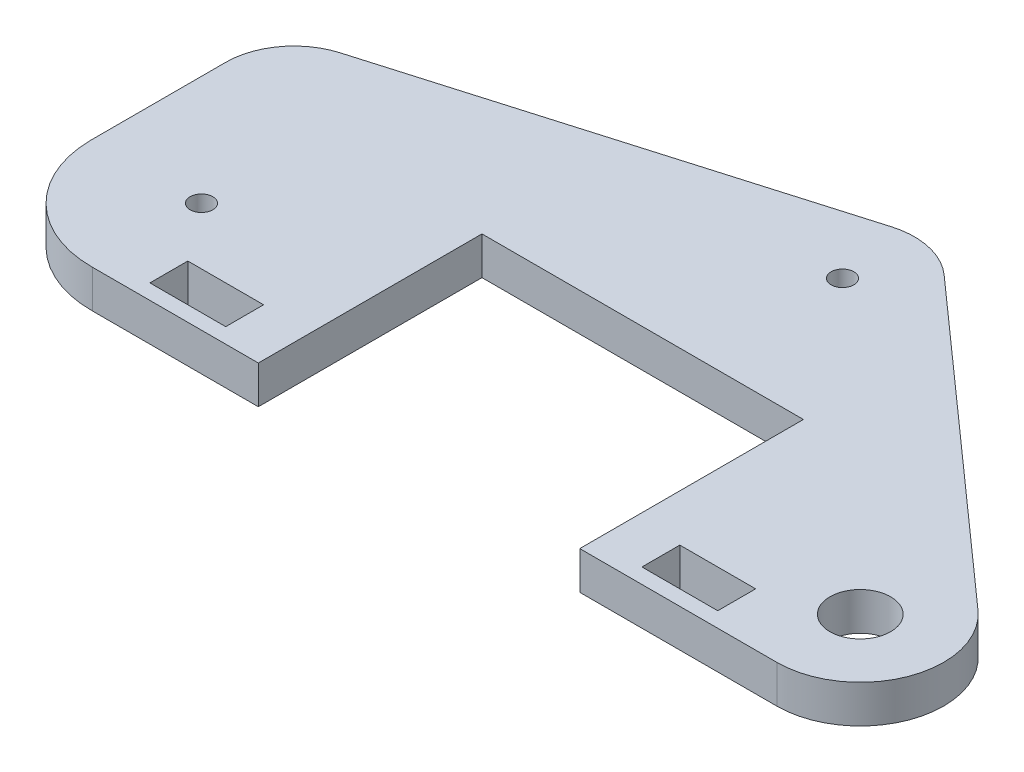
ISO-10303-21;
HEADER;
FILE_DESCRIPTION(('STEP AP214'),'2;1');
FILE_NAME('part.step','',(''),(''),'','','');
FILE_SCHEMA(('AUTOMOTIVE_DESIGN { 1 0 10303 214 1 1 1 1 }'));
ENDSEC;
DATA;
#1=APPLICATION_CONTEXT('core data for automotive mechanical design processes');
#2=APPLICATION_PROTOCOL_DEFINITION('international standard','automotive_design',2000,#1);
#3=PRODUCT_CONTEXT('',#1,'mechanical');
#4=PRODUCT('Part','Part','',(#3));
#5=PRODUCT_RELATED_PRODUCT_CATEGORY('part','',(#4));
#6=PRODUCT_DEFINITION_FORMATION('','',#4);
#7=PRODUCT_DEFINITION_CONTEXT('part definition',#1,'design');
#8=PRODUCT_DEFINITION('design','',#6,#7);
#9=PRODUCT_DEFINITION_SHAPE('','',#8);
#10=(LENGTH_UNIT() NAMED_UNIT(*) SI_UNIT(.MILLI.,.METRE.));
#11=(NAMED_UNIT(*) PLANE_ANGLE_UNIT() SI_UNIT($,.RADIAN.));
#12=(NAMED_UNIT(*) SI_UNIT($,.STERADIAN.) SOLID_ANGLE_UNIT());
#13=UNCERTAINTY_MEASURE_WITH_UNIT(LENGTH_MEASURE(1.E-05),#10,'distance_accuracy_value','');
#14=(GEOMETRIC_REPRESENTATION_CONTEXT(3) GLOBAL_UNCERTAINTY_ASSIGNED_CONTEXT((#13)) GLOBAL_UNIT_ASSIGNED_CONTEXT((#10,
#11,#12)) REPRESENTATION_CONTEXT('',''));
#15=CARTESIAN_POINT('',(0.,0.,0.));
#16=DIRECTION('',(0.,0.,1.));
#17=DIRECTION('',(1.,0.,0.));
#18=AXIS2_PLACEMENT_3D('',#15,#16,#17);
#19=CARTESIAN_POINT('',(90.4028342932197,5.,3.49963534397116));
#20=DIRECTION('',(0.,1.,0.));
#21=DIRECTION('',(0.,0.,1.));
#22=AXIS2_PLACEMENT_3D('',#19,#20,#21);
#23=PLANE('',#22);
#24=DIRECTION('',(0.,0.,-1.));
#25=VECTOR('',#24,1.);
#26=CARTESIAN_POINT('',(15.7,5.,7.49963534397117));
#27=LINE('',#26,#25);
#28=CARTESIAN_POINT('',(15.7,5.,12.4996353439712));
#29=VERTEX_POINT('',#28);
#30=CARTESIAN_POINT('',(15.7,5.,7.49963534397117));
#31=VERTEX_POINT('',#30);
#32=EDGE_CURVE('E240',#29,#31,#27,.T.);
#33=ORIENTED_EDGE('',*,*,#32,.F.);
#34=DIRECTION('',(1.,0.,0.));
#35=VECTOR('',#34,1.);
#36=CARTESIAN_POINT('',(15.7,5.,12.4996353439712));
#37=LINE('',#36,#35);
#38=CARTESIAN_POINT('',(5.7,5.,12.4996353439712));
#39=VERTEX_POINT('',#38);
#40=EDGE_CURVE('E237',#39,#29,#37,.T.);
#41=ORIENTED_EDGE('',*,*,#40,.F.);
#42=DIRECTION('',(0.,0.,1.));
#43=VECTOR('',#42,1.);
#44=CARTESIAN_POINT('',(5.7,5.,12.4996353439712));
#45=LINE('',#44,#43);
#46=CARTESIAN_POINT('',(5.7,5.,7.49963534397117));
#47=VERTEX_POINT('',#46);
#48=EDGE_CURVE('E248',#47,#39,#45,.T.);
#49=ORIENTED_EDGE('',*,*,#48,.F.);
#50=DIRECTION('',(-1.,0.,0.));
#51=VECTOR('',#50,1.);
#52=CARTESIAN_POINT('',(5.7,5.,7.49963534397117));
#53=LINE('',#52,#51);
#54=EDGE_CURVE('E244',#31,#47,#53,.T.);
#55=ORIENTED_EDGE('',*,*,#54,.F.);
#56=EDGE_LOOP('',(#33,#41,#49,#55));
#57=FACE_BOUND('',#56,.T.);
#58=CARTESIAN_POINT('',(90.4028342932197,5.,3.49963534397116));
#59=DIRECTION('',(0.,1.,0.));
#60=DIRECTION('',(0.,0.,1.));
#61=AXIS2_PLACEMENT_3D('',#58,#59,#60);
#62=CIRCLE('',#61,4.00000000000001);
#63=CARTESIAN_POINT('',(90.4028342932197,5.,7.49963534397117));
#64=VERTEX_POINT('',#63);
#65=EDGE_CURVE('E280',#64,#64,#62,.T.);
#66=ORIENTED_EDGE('',*,*,#65,.F.);
#67=EDGE_LOOP('',(#66));
#68=FACE_BOUND('',#67,.T.);
#69=DIRECTION('',(0.,0.,1.));
#70=VECTOR('',#69,1.);
#71=CARTESIAN_POINT('',(64.4028342932197,5.,-15.0003646560288));
#72=LINE('',#71,#70);
#73=CARTESIAN_POINT('',(64.4028342932197,5.,-15.0003646560288));
#74=VERTEX_POINT('',#73);
#75=CARTESIAN_POINT('',(64.4028342932197,5.,14.4996353439712));
#76=VERTEX_POINT('',#75);
#77=EDGE_CURVE('E296',#74,#76,#72,.T.);
#78=ORIENTED_EDGE('',*,*,#77,.T.);
#79=DIRECTION('',(1.,0.,0.));
#80=VECTOR('',#79,1.);
#81=CARTESIAN_POINT('',(64.4028342932197,5.,14.4996353439712));
#82=LINE('',#81,#80);
#83=CARTESIAN_POINT('',(90.4028342932197,5.,14.4996353439711));
#84=VERTEX_POINT('',#83);
#85=EDGE_CURVE('E300',#76,#84,#82,.T.);
#86=ORIENTED_EDGE('',*,*,#85,.T.);
#87=CARTESIAN_POINT('',(90.4028342932197,5.,3.49963534397116));
#88=DIRECTION('',(0.,1.,0.));
#89=DIRECTION('',(0.,0.,1.));
#90=AXIS2_PLACEMENT_3D('',#87,#88,#89);
#91=CIRCLE('',#90,11.);
#92=CARTESIAN_POINT('',(97.7151031431947,5.,-4.71807262514555));
#93=VERTEX_POINT('',#92);
#94=EDGE_CURVE('E304',#84,#93,#91,.T.);
#95=ORIENTED_EDGE('',*,*,#94,.T.);
#96=DIRECTION('',(-0.747064360828861,0.,-0.664751713634019));
#97=VECTOR('',#96,1.);
#98=CARTESIAN_POINT('',(57.1685900471543,5.,-40.79711142787));
#99=LINE('',#98,#97);
#100=CARTESIAN_POINT('',(57.1685900471542,5.,-40.7971114278699));
#101=VERTEX_POINT('',#100);
#102=EDGE_CURVE('E307',#93,#101,#99,.T.);
#103=ORIENTED_EDGE('',*,*,#102,.T.);
#104=CARTESIAN_POINT('',(50.8534487676347,5.,-33.7));
#105=DIRECTION('',(0.,1.,0.));
#106=DIRECTION('',(0.,0.,1.));
#107=AXIS2_PLACEMENT_3D('',#104,#105,#106);
#108=CIRCLE('',#107,9.49999999999435);
#109=CARTESIAN_POINT('',(48.1803960763869,5.,-42.8161828255966));
#110=VERTEX_POINT('',#109);
#111=EDGE_CURVE('E310',#101,#110,#108,.T.);
#112=ORIENTED_EDGE('',*,*,#111,.T.);
#113=DIRECTION('',(-0.959598192168644,0.,0.281373967499963));
#114=VECTOR('',#113,1.);
#115=CARTESIAN_POINT('',(-8.03200105147063,5.,-26.3335494362987));
#116=LINE('',#115,#114);
#117=CARTESIAN_POINT('',(-8.03200105147056,5.,-26.3335494362985));
#118=VERTEX_POINT('',#117);
#119=EDGE_CURVE('E313',#110,#118,#116,.T.);
#120=ORIENTED_EDGE('',*,*,#119,.T.);
#121=CARTESIAN_POINT('',(-5.49963534397116,5.,-17.6971657067804));
#122=DIRECTION('',(0.,1.,0.));
#123=DIRECTION('',(0.,0.,1.));
#124=AXIS2_PLACEMENT_3D('',#121,#122,#123);
#125=CIRCLE('',#124,9.00000000000024);
#126=CARTESIAN_POINT('',(-14.4996353439712,5.,-17.6971657067806));
#127=VERTEX_POINT('',#126);
#128=EDGE_CURVE('E316',#118,#127,#125,.T.);
#129=ORIENTED_EDGE('',*,*,#128,.T.);
#130=DIRECTION('',(0.,0.,1.));
#131=VECTOR('',#130,1.);
#132=CARTESIAN_POINT('',(-14.4996353439712,5.,0.102834293219351));
#133=LINE('',#132,#131);
#134=CARTESIAN_POINT('',(-14.4996353439712,5.,0.102834293219355));
#135=VERTEX_POINT('',#134);
#136=EDGE_CURVE('E319',#127,#135,#133,.T.);
#137=ORIENTED_EDGE('',*,*,#136,.T.);
#138=CARTESIAN_POINT('',(0.,5.,0.));
#139=DIRECTION('',(0.,1.,0.));
#140=DIRECTION('',(0.,0.,1.));
#141=AXIS2_PLACEMENT_3D('',#138,#139,#140);
#142=CIRCLE('',#141,14.5);
#143=CARTESIAN_POINT('',(0.102834293219708,5.,14.4996353439712));
#144=VERTEX_POINT('',#143);
#145=EDGE_CURVE('E322',#135,#144,#142,.T.);
#146=ORIENTED_EDGE('',*,*,#145,.T.);
#147=DIRECTION('',(1.,0.,0.));
#148=VECTOR('',#147,1.);
#149=CARTESIAN_POINT('',(0.102834293219708,5.,14.4996353439712));
#150=LINE('',#149,#148);
#151=CARTESIAN_POINT('',(22.0028342932197,5.,14.4996353439712));
#152=VERTEX_POINT('',#151);
#153=EDGE_CURVE('E325',#144,#152,#150,.T.);
#154=ORIENTED_EDGE('',*,*,#153,.T.);
#155=DIRECTION('',(0.,0.,-1.));
#156=VECTOR('',#155,1.);
#157=CARTESIAN_POINT('',(22.0028342932197,5.,14.4996353439712));
#158=LINE('',#157,#156);
#159=CARTESIAN_POINT('',(22.0028342932197,5.,-15.0003646560288));
#160=VERTEX_POINT('',#159);
#161=EDGE_CURVE('E328',#152,#160,#158,.T.);
#162=ORIENTED_EDGE('',*,*,#161,.T.);
#163=DIRECTION('',(1.,0.,0.));
#164=VECTOR('',#163,1.);
#165=CARTESIAN_POINT('',(22.0028342932197,5.,-15.0003646560288));
#166=LINE('',#165,#164);
#167=EDGE_CURVE('E331',#160,#74,#166,.T.);
#168=ORIENTED_EDGE('',*,*,#167,.T.);
#169=EDGE_LOOP('',(#78,#86,#95,#103,#112,#120,#129,#137,#146,#154,#162,#168));
#170=FACE_BOUND('',#169,.T.);
#171=CARTESIAN_POINT('',(0.,5.,0.));
#172=DIRECTION('',(0.,1.,0.));
#173=DIRECTION('',(0.,0.,1.));
#174=AXIS2_PLACEMENT_3D('',#171,#172,#173);
#175=CIRCLE('',#174,1.5);
#176=CARTESIAN_POINT('',(0.,5.,1.5));
#177=VERTEX_POINT('',#176);
#178=EDGE_CURVE('E288',#177,#177,#175,.T.);
#179=ORIENTED_EDGE('',*,*,#178,.F.);
#180=EDGE_LOOP('',(#179));
#181=FACE_BOUND('',#180,.T.);
#182=CARTESIAN_POINT('',(50.8534487676347,5.,-33.7));
#183=DIRECTION('',(0.,1.,0.));
#184=DIRECTION('',(0.,0.,1.));
#185=AXIS2_PLACEMENT_3D('',#182,#183,#184);
#186=CIRCLE('',#185,1.5);
#187=CARTESIAN_POINT('',(50.8534487676347,5.,-32.2));
#188=VERTEX_POINT('',#187);
#189=EDGE_CURVE('E229',#188,#188,#186,.T.);
#190=ORIENTED_EDGE('',*,*,#189,.F.);
#191=EDGE_LOOP('',(#190));
#192=FACE_BOUND('',#191,.T.);
#193=DIRECTION('',(1.,0.,0.));
#194=VECTOR('',#193,1.);
#195=CARTESIAN_POINT('',(70.6028342932197,5.,12.4996353439712));
#196=LINE('',#195,#194);
#197=CARTESIAN_POINT('',(70.6028342932197,5.,12.4996353439712));
#198=VERTEX_POINT('',#197);
#199=CARTESIAN_POINT('',(80.6028342932197,5.,12.4996353439712));
#200=VERTEX_POINT('',#199);
#201=EDGE_CURVE('E190',#198,#200,#196,.T.);
#202=ORIENTED_EDGE('',*,*,#201,.F.);
#203=DIRECTION('',(0.,0.,1.));
#204=VECTOR('',#203,1.);
#205=CARTESIAN_POINT('',(70.6028342932197,5.,7.49963534397117));
#206=LINE('',#205,#204);
#207=CARTESIAN_POINT('',(70.6028342932197,5.,7.49963534397117));
#208=VERTEX_POINT('',#207);
#209=EDGE_CURVE('E181',#208,#198,#206,.T.);
#210=ORIENTED_EDGE('',*,*,#209,.F.);
#211=DIRECTION('',(-1.,0.,0.));
#212=VECTOR('',#211,1.);
#213=CARTESIAN_POINT('',(80.6028342932197,5.,7.49963534397117));
#214=LINE('',#213,#212);
#215=CARTESIAN_POINT('',(80.6028342932197,5.,7.49963534397117));
#216=VERTEX_POINT('',#215);
#217=EDGE_CURVE('E207',#216,#208,#214,.T.);
#218=ORIENTED_EDGE('',*,*,#217,.F.);
#219=DIRECTION('',(0.,0.,-1.));
#220=VECTOR('',#219,1.);
#221=CARTESIAN_POINT('',(80.6028342932197,5.,12.4996353439712));
#222=LINE('',#221,#220);
#223=EDGE_CURVE('E203',#200,#216,#222,.T.);
#224=ORIENTED_EDGE('',*,*,#223,.F.);
#225=EDGE_LOOP('',(#202,#210,#218,#224));
#226=FACE_BOUND('',#225,.T.);
#227=ADVANCED_FACE('F43',(#57,#68,#170,#181,#192,#226),#23,.T.);
#228=CARTESIAN_POINT('',(90.4028342932197,0.,3.49963534397116));
#229=DIRECTION('',(0.,1.,0.));
#230=DIRECTION('',(0.,0.,1.));
#231=AXIS2_PLACEMENT_3D('',#228,#229,#230);
#232=PLANE('',#231);
#233=CARTESIAN_POINT('',(50.8534487676347,0.,-33.7));
#234=DIRECTION('',(0.,1.,0.));
#235=DIRECTION('',(0.,0.,1.));
#236=AXIS2_PLACEMENT_3D('',#233,#234,#235);
#237=CIRCLE('',#236,1.5);
#238=CARTESIAN_POINT('',(50.8534487676347,0.,-32.2));
#239=VERTEX_POINT('',#238);
#240=EDGE_CURVE('E199',#239,#239,#237,.T.);
#241=ORIENTED_EDGE('',*,*,#240,.T.);
#242=EDGE_LOOP('',(#241));
#243=FACE_BOUND('',#242,.T.);
#244=DIRECTION('',(1.,0.,0.));
#245=VECTOR('',#244,1.);
#246=CARTESIAN_POINT('',(15.7,0.,12.4996353439712));
#247=LINE('',#246,#245);
#248=CARTESIAN_POINT('',(5.7,0.,12.4996353439712));
#249=VERTEX_POINT('',#248);
#250=CARTESIAN_POINT('',(15.7,0.,12.4996353439712));
#251=VERTEX_POINT('',#250);
#252=EDGE_CURVE('E233',#249,#251,#247,.T.);
#253=ORIENTED_EDGE('',*,*,#252,.T.);
#254=DIRECTION('',(0.,0.,-1.));
#255=VECTOR('',#254,1.);
#256=CARTESIAN_POINT('',(15.7,0.,7.49963534397117));
#257=LINE('',#256,#255);
#258=CARTESIAN_POINT('',(15.7,0.,7.49963534397117));
#259=VERTEX_POINT('',#258);
#260=EDGE_CURVE('E255',#251,#259,#257,.T.);
#261=ORIENTED_EDGE('',*,*,#260,.T.);
#262=DIRECTION('',(-1.,0.,0.));
#263=VECTOR('',#262,1.);
#264=CARTESIAN_POINT('',(5.7,0.,7.49963534397117));
#265=LINE('',#264,#263);
#266=CARTESIAN_POINT('',(5.7,0.,7.49963534397117));
#267=VERTEX_POINT('',#266);
#268=EDGE_CURVE('E259',#259,#267,#265,.T.);
#269=ORIENTED_EDGE('',*,*,#268,.T.);
#270=DIRECTION('',(0.,0.,1.));
#271=VECTOR('',#270,1.);
#272=CARTESIAN_POINT('',(5.7,0.,12.4996353439712));
#273=LINE('',#272,#271);
#274=EDGE_CURVE('E241',#267,#249,#273,.T.);
#275=ORIENTED_EDGE('',*,*,#274,.T.);
#276=EDGE_LOOP('',(#253,#261,#269,#275));
#277=FACE_BOUND('',#276,.T.);
#278=DIRECTION('',(0.,0.,1.));
#279=VECTOR('',#278,1.);
#280=CARTESIAN_POINT('',(64.4028342932197,0.,-15.0003646560288));
#281=LINE('',#280,#279);
#282=CARTESIAN_POINT('',(64.4028342932197,0.,-15.0003646560288));
#283=VERTEX_POINT('',#282);
#284=CARTESIAN_POINT('',(64.4028342932197,0.,14.4996353439712));
#285=VERTEX_POINT('',#284);
#286=EDGE_CURVE('E292',#283,#285,#281,.T.);
#287=ORIENTED_EDGE('',*,*,#286,.F.);
#288=DIRECTION('',(1.,0.,0.));
#289=VECTOR('',#288,1.);
#290=CARTESIAN_POINT('',(22.0028342932197,0.,-15.0003646560288));
#291=LINE('',#290,#289);
#292=CARTESIAN_POINT('',(22.0028342932197,0.,-15.0003646560288));
#293=VERTEX_POINT('',#292);
#294=EDGE_CURVE('E301',#293,#283,#291,.T.);
#295=ORIENTED_EDGE('',*,*,#294,.F.);
#296=DIRECTION('',(0.,0.,-1.));
#297=VECTOR('',#296,1.);
#298=CARTESIAN_POINT('',(22.0028342932197,0.,14.4996353439712));
#299=LINE('',#298,#297);
#300=CARTESIAN_POINT('',(22.0028342932197,0.,14.4996353439712));
#301=VERTEX_POINT('',#300);
#302=EDGE_CURVE('E365',#301,#293,#299,.T.);
#303=ORIENTED_EDGE('',*,*,#302,.F.);
#304=DIRECTION('',(1.,0.,0.));
#305=VECTOR('',#304,1.);
#306=CARTESIAN_POINT('',(0.102834293219708,0.,14.4996353439712));
#307=LINE('',#306,#305);
#308=CARTESIAN_POINT('',(0.102834293219708,0.,14.4996353439712));
#309=VERTEX_POINT('',#308);
#310=EDGE_CURVE('E362',#309,#301,#307,.T.);
#311=ORIENTED_EDGE('',*,*,#310,.F.);
#312=CARTESIAN_POINT('',(0.,0.,0.));
#313=DIRECTION('',(0.,1.,0.));
#314=DIRECTION('',(0.,0.,1.));
#315=AXIS2_PLACEMENT_3D('',#312,#313,#314);
#316=CIRCLE('',#315,14.5);
#317=CARTESIAN_POINT('',(-14.4996353439712,0.,0.102834293219355));
#318=VERTEX_POINT('',#317);
#319=EDGE_CURVE('E359',#318,#309,#316,.T.);
#320=ORIENTED_EDGE('',*,*,#319,.F.);
#321=DIRECTION('',(0.,0.,1.));
#322=VECTOR('',#321,1.);
#323=CARTESIAN_POINT('',(-14.4996353439712,0.,0.102834293219351));
#324=LINE('',#323,#322);
#325=CARTESIAN_POINT('',(-14.4996353439712,0.,-17.6971657067806));
#326=VERTEX_POINT('',#325);
#327=EDGE_CURVE('E356',#326,#318,#324,.T.);
#328=ORIENTED_EDGE('',*,*,#327,.F.);
#329=CARTESIAN_POINT('',(-5.49963534397116,0.,-17.6971657067804));
#330=DIRECTION('',(0.,1.,0.));
#331=DIRECTION('',(0.,0.,1.));
#332=AXIS2_PLACEMENT_3D('',#329,#330,#331);
#333=CIRCLE('',#332,9.00000000000024);
#334=CARTESIAN_POINT('',(-8.03200105147056,0.,-26.3335494362985));
#335=VERTEX_POINT('',#334);
#336=EDGE_CURVE('E353',#335,#326,#333,.T.);
#337=ORIENTED_EDGE('',*,*,#336,.F.);
#338=DIRECTION('',(-0.959598192168644,0.,0.281373967499963));
#339=VECTOR('',#338,1.);
#340=CARTESIAN_POINT('',(-8.03200105147063,0.,-26.3335494362987));
#341=LINE('',#340,#339);
#342=CARTESIAN_POINT('',(48.1803960763869,0.,-42.8161828255966));
#343=VERTEX_POINT('',#342);
#344=EDGE_CURVE('E350',#343,#335,#341,.T.);
#345=ORIENTED_EDGE('',*,*,#344,.F.);
#346=CARTESIAN_POINT('',(50.8534487676347,0.,-33.7));
#347=DIRECTION('',(0.,1.,0.));
#348=DIRECTION('',(0.,0.,1.));
#349=AXIS2_PLACEMENT_3D('',#346,#347,#348);
#350=CIRCLE('',#349,9.49999999999435);
#351=CARTESIAN_POINT('',(57.1685900471542,0.,-40.7971114278699));
#352=VERTEX_POINT('',#351);
#353=EDGE_CURVE('E347',#352,#343,#350,.T.);
#354=ORIENTED_EDGE('',*,*,#353,.F.);
#355=DIRECTION('',(-0.747064360828861,0.,-0.664751713634019));
#356=VECTOR('',#355,1.);
#357=CARTESIAN_POINT('',(57.1685900471543,0.,-40.79711142787));
#358=LINE('',#357,#356);
#359=CARTESIAN_POINT('',(97.7151031431947,0.,-4.71807262514555));
#360=VERTEX_POINT('',#359);
#361=EDGE_CURVE('E344',#360,#352,#358,.T.);
#362=ORIENTED_EDGE('',*,*,#361,.F.);
#363=CARTESIAN_POINT('',(90.4028342932197,0.,3.49963534397116));
#364=DIRECTION('',(0.,1.,0.));
#365=DIRECTION('',(0.,0.,1.));
#366=AXIS2_PLACEMENT_3D('',#363,#364,#365);
#367=CIRCLE('',#366,11.);
#368=CARTESIAN_POINT('',(90.4028342932197,0.,14.4996353439711));
#369=VERTEX_POINT('',#368);
#370=EDGE_CURVE('E341',#369,#360,#367,.T.);
#371=ORIENTED_EDGE('',*,*,#370,.F.);
#372=DIRECTION('',(1.,0.,0.));
#373=VECTOR('',#372,1.);
#374=CARTESIAN_POINT('',(64.4028342932197,0.,14.4996353439712));
#375=LINE('',#374,#373);
#376=EDGE_CURVE('E338',#285,#369,#375,.T.);
#377=ORIENTED_EDGE('',*,*,#376,.F.);
#378=EDGE_LOOP('',(#287,#295,#303,#311,#320,#328,#337,#345,#354,#362,#371,#377));
#379=FACE_BOUND('',#378,.T.);
#380=CARTESIAN_POINT('',(0.,0.,0.));
#381=DIRECTION('',(0.,1.,0.));
#382=DIRECTION('',(0.,0.,1.));
#383=AXIS2_PLACEMENT_3D('',#380,#381,#382);
#384=CIRCLE('',#383,1.5);
#385=CARTESIAN_POINT('',(0.,0.,1.5));
#386=VERTEX_POINT('',#385);
#387=EDGE_CURVE('E284',#386,#386,#384,.T.);
#388=ORIENTED_EDGE('',*,*,#387,.T.);
#389=EDGE_LOOP('',(#388));
#390=FACE_BOUND('',#389,.T.);
#391=CARTESIAN_POINT('',(90.4028342932197,0.,3.49963534397116));
#392=DIRECTION('',(0.,1.,0.));
#393=DIRECTION('',(0.,0.,1.));
#394=AXIS2_PLACEMENT_3D('',#391,#392,#393);
#395=CIRCLE('',#394,4.00000000000001);
#396=CARTESIAN_POINT('',(90.4028342932197,0.,7.49963534397117));
#397=VERTEX_POINT('',#396);
#398=EDGE_CURVE('E279',#397,#397,#395,.T.);
#399=ORIENTED_EDGE('',*,*,#398,.T.);
#400=EDGE_LOOP('',(#399));
#401=FACE_BOUND('',#400,.T.);
#402=DIRECTION('',(0.,0.,1.));
#403=VECTOR('',#402,1.);
#404=CARTESIAN_POINT('',(70.6028342932197,0.,7.49963534397117));
#405=LINE('',#404,#403);
#406=CARTESIAN_POINT('',(70.6028342932197,0.,7.49963534397117));
#407=VERTEX_POINT('',#406);
#408=CARTESIAN_POINT('',(70.6028342932197,0.,12.4996353439712));
#409=VERTEX_POINT('',#408);
#410=EDGE_CURVE('E67',#407,#409,#405,.T.);
#411=ORIENTED_EDGE('',*,*,#410,.T.);
#412=DIRECTION('',(1.,0.,0.));
#413=VECTOR('',#412,1.);
#414=CARTESIAN_POINT('',(70.6028342932197,0.,12.4996353439712));
#415=LINE('',#414,#413);
#416=CARTESIAN_POINT('',(80.6028342932197,0.,12.4996353439712));
#417=VERTEX_POINT('',#416);
#418=EDGE_CURVE('E197',#409,#417,#415,.T.);
#419=ORIENTED_EDGE('',*,*,#418,.T.);
#420=DIRECTION('',(0.,0.,-1.));
#421=VECTOR('',#420,1.);
#422=CARTESIAN_POINT('',(80.6028342932197,0.,12.4996353439712));
#423=LINE('',#422,#421);
#424=CARTESIAN_POINT('',(80.6028342932197,0.,7.49963534397117));
#425=VERTEX_POINT('',#424);
#426=EDGE_CURVE('E216',#417,#425,#423,.T.);
#427=ORIENTED_EDGE('',*,*,#426,.T.);
#428=DIRECTION('',(-1.,0.,0.));
#429=VECTOR('',#428,1.);
#430=CARTESIAN_POINT('',(80.6028342932197,0.,7.49963534397117));
#431=LINE('',#430,#429);
#432=EDGE_CURVE('E191',#425,#407,#431,.T.);
#433=ORIENTED_EDGE('',*,*,#432,.T.);
#434=EDGE_LOOP('',(#411,#419,#427,#433));
#435=FACE_BOUND('',#434,.T.);
#436=ADVANCED_FACE('F420',(#243,#277,#379,#390,#401,#435),#232,.F.);
#437=CARTESIAN_POINT('',(64.4028342932197,5.,-15.0003646560288));
#438=DIRECTION('',(1.,0.,0.));
#439=DIRECTION('',(0.,0.,-1.));
#440=AXIS2_PLACEMENT_3D('',#437,#438,#439);
#441=PLANE('',#440);
#442=ORIENTED_EDGE('',*,*,#286,.T.);
#443=DIRECTION('',(0.,-1.,0.));
#444=VECTOR('',#443,1.);
#445=CARTESIAN_POINT('',(64.4028342932197,5.,14.4996353439712));
#446=LINE('',#445,#444);
#447=EDGE_CURVE('E11',#76,#285,#446,.T.);
#448=ORIENTED_EDGE('',*,*,#447,.F.);
#449=ORIENTED_EDGE('',*,*,#77,.F.);
#450=DIRECTION('',(0.,-1.,0.));
#451=VECTOR('',#450,1.);
#452=CARTESIAN_POINT('',(64.4028342932197,5.,-15.0003646560288));
#453=LINE('',#452,#451);
#454=EDGE_CURVE('E334',#74,#283,#453,.T.);
#455=ORIENTED_EDGE('',*,*,#454,.T.);
#456=EDGE_LOOP('',(#442,#448,#449,#455));
#457=FACE_BOUND('',#456,.T.);
#458=ADVANCED_FACE('F45',(#457),#441,.F.);
#459=CARTESIAN_POINT('',(64.4028342932197,5.,14.4996353439712));
#460=DIRECTION('',(0.,0.,-1.));
#461=DIRECTION('',(-1.,0.,0.));
#462=AXIS2_PLACEMENT_3D('',#459,#460,#461);
#463=PLANE('',#462);
#464=ORIENTED_EDGE('',*,*,#376,.T.);
#465=DIRECTION('',(0.,-1.,0.));
#466=VECTOR('',#465,1.);
#467=CARTESIAN_POINT('',(90.4028342932197,5.,14.4996353439711));
#468=LINE('',#467,#466);
#469=EDGE_CURVE('E52',#84,#369,#468,.T.);
#470=ORIENTED_EDGE('',*,*,#469,.F.);
#471=ORIENTED_EDGE('',*,*,#85,.F.);
#472=ORIENTED_EDGE('',*,*,#447,.T.);
#473=EDGE_LOOP('',(#464,#470,#471,#472));
#474=FACE_BOUND('',#473,.T.);
#475=ADVANCED_FACE('F438',(#474),#463,.F.);
#476=CARTESIAN_POINT('',(90.4028342932197,5.,3.49963534397116));
#477=DIRECTION('',(0.,-1.,0.));
#478=DIRECTION('',(0.,0.,-1.));
#479=AXIS2_PLACEMENT_3D('',#476,#477,#478);
#480=CYLINDRICAL_SURFACE('',#479,11.);
#481=ORIENTED_EDGE('',*,*,#370,.T.);
#482=DIRECTION('',(0.,-1.,0.));
#483=VECTOR('',#482,1.);
#484=CARTESIAN_POINT('',(97.7151031431947,5.,-4.71807262514555));
#485=LINE('',#484,#483);
#486=EDGE_CURVE('E405',#93,#360,#485,.T.);
#487=ORIENTED_EDGE('',*,*,#486,.F.);
#488=ORIENTED_EDGE('',*,*,#94,.F.);
#489=ORIENTED_EDGE('',*,*,#469,.T.);
#490=EDGE_LOOP('',(#481,#487,#488,#489));
#491=FACE_BOUND('',#490,.T.);
#492=ADVANCED_FACE('F414',(#491),#480,.T.);
#493=CARTESIAN_POINT('',(57.1685900471543,5.,-40.79711142787));
#494=DIRECTION('',(-0.664751713634019,0.,0.747064360828861));
#495=DIRECTION('',(0.747064360828861,0.,0.664751713634019));
#496=AXIS2_PLACEMENT_3D('',#493,#494,#495);
#497=PLANE('',#496);
#498=ORIENTED_EDGE('',*,*,#361,.T.);
#499=DIRECTION('',(0.,-1.,0.));
#500=VECTOR('',#499,1.);
#501=CARTESIAN_POINT('',(57.1685900471542,5.,-40.7971114278699));
#502=LINE('',#501,#500);
#503=EDGE_CURVE('E401',#101,#352,#502,.T.);
#504=ORIENTED_EDGE('',*,*,#503,.F.);
#505=ORIENTED_EDGE('',*,*,#102,.F.);
#506=ORIENTED_EDGE('',*,*,#486,.T.);
#507=EDGE_LOOP('',(#498,#504,#505,#506));
#508=FACE_BOUND('',#507,.T.);
#509=ADVANCED_FACE('F426',(#508),#497,.F.);
#510=CARTESIAN_POINT('',(50.8534487676347,5.,-33.7));
#511=DIRECTION('',(0.,-1.,0.));
#512=DIRECTION('',(0.,0.,-1.));
#513=AXIS2_PLACEMENT_3D('',#510,#511,#512);
#514=CYLINDRICAL_SURFACE('',#513,9.49999999999435);
#515=ORIENTED_EDGE('',*,*,#353,.T.);
#516=DIRECTION('',(0.,-1.,0.));
#517=VECTOR('',#516,1.);
#518=CARTESIAN_POINT('',(48.1803960763869,5.,-42.8161828255966));
#519=LINE('',#518,#517);
#520=EDGE_CURVE('E397',#110,#343,#519,.T.);
#521=ORIENTED_EDGE('',*,*,#520,.F.);
#522=ORIENTED_EDGE('',*,*,#111,.F.);
#523=ORIENTED_EDGE('',*,*,#503,.T.);
#524=EDGE_LOOP('',(#515,#521,#522,#523));
#525=FACE_BOUND('',#524,.T.);
#526=ADVANCED_FACE('F430',(#525),#514,.T.);
#527=CARTESIAN_POINT('',(-8.03200105147063,5.,-26.3335494362987));
#528=DIRECTION('',(0.281373967499963,0.,0.959598192168644));
#529=DIRECTION('',(0.959598192168644,0.,-0.281373967499963));
#530=AXIS2_PLACEMENT_3D('',#527,#528,#529);
#531=PLANE('',#530);
#532=ORIENTED_EDGE('',*,*,#344,.T.);
#533=DIRECTION('',(0.,-1.,0.));
#534=VECTOR('',#533,1.);
#535=CARTESIAN_POINT('',(-8.03200105147056,5.,-26.3335494362985));
#536=LINE('',#535,#534);
#537=EDGE_CURVE('E393',#118,#335,#536,.T.);
#538=ORIENTED_EDGE('',*,*,#537,.F.);
#539=ORIENTED_EDGE('',*,*,#119,.F.);
#540=ORIENTED_EDGE('',*,*,#520,.T.);
#541=EDGE_LOOP('',(#532,#538,#539,#540));
#542=FACE_BOUND('',#541,.T.);
#543=ADVANCED_FACE('F471',(#542),#531,.F.);
#544=CARTESIAN_POINT('',(-5.49963534397116,5.,-17.6971657067804));
#545=DIRECTION('',(0.,-1.,0.));
#546=DIRECTION('',(0.,0.,-1.));
#547=AXIS2_PLACEMENT_3D('',#544,#545,#546);
#548=CYLINDRICAL_SURFACE('',#547,9.00000000000024);
#549=ORIENTED_EDGE('',*,*,#336,.T.);
#550=DIRECTION('',(0.,-1.,0.));
#551=VECTOR('',#550,1.);
#552=CARTESIAN_POINT('',(-14.4996353439712,5.,-17.6971657067806));
#553=LINE('',#552,#551);
#554=EDGE_CURVE('E389',#127,#326,#553,.T.);
#555=ORIENTED_EDGE('',*,*,#554,.F.);
#556=ORIENTED_EDGE('',*,*,#128,.F.);
#557=ORIENTED_EDGE('',*,*,#537,.T.);
#558=EDGE_LOOP('',(#549,#555,#556,#557));
#559=FACE_BOUND('',#558,.T.);
#560=ADVANCED_FACE('F469',(#559),#548,.T.);
#561=CARTESIAN_POINT('',(-14.4996353439712,5.,0.102834293219351));
#562=DIRECTION('',(1.,0.,0.));
#563=DIRECTION('',(0.,0.,-1.));
#564=AXIS2_PLACEMENT_3D('',#561,#562,#563);
#565=PLANE('',#564);
#566=ORIENTED_EDGE('',*,*,#327,.T.);
#567=DIRECTION('',(0.,-1.,0.));
#568=VECTOR('',#567,1.);
#569=CARTESIAN_POINT('',(-14.4996353439712,5.,0.102834293219355));
#570=LINE('',#569,#568);
#571=EDGE_CURVE('E385',#135,#318,#570,.T.);
#572=ORIENTED_EDGE('',*,*,#571,.F.);
#573=ORIENTED_EDGE('',*,*,#136,.F.);
#574=ORIENTED_EDGE('',*,*,#554,.T.);
#575=EDGE_LOOP('',(#566,#572,#573,#574));
#576=FACE_BOUND('',#575,.T.);
#577=ADVANCED_FACE('F465',(#576),#565,.F.);
#578=CARTESIAN_POINT('',(0.,5.,0.));
#579=DIRECTION('',(0.,-1.,0.));
#580=DIRECTION('',(0.,0.,-1.));
#581=AXIS2_PLACEMENT_3D('',#578,#579,#580);
#582=CYLINDRICAL_SURFACE('',#581,14.5);
#583=ORIENTED_EDGE('',*,*,#319,.T.);
#584=DIRECTION('',(0.,-1.,0.));
#585=VECTOR('',#584,1.);
#586=CARTESIAN_POINT('',(0.102834293219708,5.,14.4996353439712));
#587=LINE('',#586,#585);
#588=EDGE_CURVE('E381',#144,#309,#587,.T.);
#589=ORIENTED_EDGE('',*,*,#588,.F.);
#590=ORIENTED_EDGE('',*,*,#145,.F.);
#591=ORIENTED_EDGE('',*,*,#571,.T.);
#592=EDGE_LOOP('',(#583,#589,#590,#591));
#593=FACE_BOUND('',#592,.T.);
#594=ADVANCED_FACE('F460',(#593),#582,.T.);
#595=CARTESIAN_POINT('',(0.102834293219708,5.,14.4996353439712));
#596=DIRECTION('',(0.,0.,-1.));
#597=DIRECTION('',(-1.,0.,0.));
#598=AXIS2_PLACEMENT_3D('',#595,#596,#597);
#599=PLANE('',#598);
#600=ORIENTED_EDGE('',*,*,#310,.T.);
#601=DIRECTION('',(0.,-1.,0.));
#602=VECTOR('',#601,1.);
#603=CARTESIAN_POINT('',(22.0028342932197,5.,14.4996353439712));
#604=LINE('',#603,#602);
#605=EDGE_CURVE('E377',#152,#301,#604,.T.);
#606=ORIENTED_EDGE('',*,*,#605,.F.);
#607=ORIENTED_EDGE('',*,*,#153,.F.);
#608=ORIENTED_EDGE('',*,*,#588,.T.);
#609=EDGE_LOOP('',(#600,#606,#607,#608));
#610=FACE_BOUND('',#609,.T.);
#611=ADVANCED_FACE('F454',(#610),#599,.F.);
#612=CARTESIAN_POINT('',(22.0028342932197,5.,14.4996353439712));
#613=DIRECTION('',(-1.,0.,0.));
#614=DIRECTION('',(0.,0.,1.));
#615=AXIS2_PLACEMENT_3D('',#612,#613,#614);
#616=PLANE('',#615);
#617=ORIENTED_EDGE('',*,*,#302,.T.);
#618=DIRECTION('',(0.,-1.,0.));
#619=VECTOR('',#618,1.);
#620=CARTESIAN_POINT('',(22.0028342932197,5.,-15.0003646560288));
#621=LINE('',#620,#619);
#622=EDGE_CURVE('E373',#160,#293,#621,.T.);
#623=ORIENTED_EDGE('',*,*,#622,.F.);
#624=ORIENTED_EDGE('',*,*,#161,.F.);
#625=ORIENTED_EDGE('',*,*,#605,.T.);
#626=EDGE_LOOP('',(#617,#623,#624,#625));
#627=FACE_BOUND('',#626,.T.);
#628=ADVANCED_FACE('F450',(#627),#616,.F.);
#629=CARTESIAN_POINT('',(22.0028342932197,5.,-15.0003646560288));
#630=DIRECTION('',(0.,0.,-1.));
#631=DIRECTION('',(-1.,0.,0.));
#632=AXIS2_PLACEMENT_3D('',#629,#630,#631);
#633=PLANE('',#632);
#634=ORIENTED_EDGE('',*,*,#294,.T.);
#635=ORIENTED_EDGE('',*,*,#454,.F.);
#636=ORIENTED_EDGE('',*,*,#167,.F.);
#637=ORIENTED_EDGE('',*,*,#622,.T.);
#638=EDGE_LOOP('',(#634,#635,#636,#637));
#639=FACE_BOUND('',#638,.T.);
#640=ADVANCED_FACE('F445',(#639),#633,.F.);
#641=CARTESIAN_POINT('',(0.,5.,0.));
#642=DIRECTION('',(0.,-1.,0.));
#643=DIRECTION('',(0.,0.,-1.));
#644=AXIS2_PLACEMENT_3D('',#641,#642,#643);
#645=CYLINDRICAL_SURFACE('',#644,1.5);
#646=ORIENTED_EDGE('',*,*,#178,.T.);
#647=EDGE_LOOP('',(#646));
#648=FACE_BOUND('',#647,.T.);
#649=ORIENTED_EDGE('',*,*,#387,.F.);
#650=EDGE_LOOP('',(#649));
#651=FACE_BOUND('',#650,.T.);
#652=ADVANCED_FACE('F491',(#648,#651),#645,.F.);
#653=CARTESIAN_POINT('',(90.4028342932197,5.,3.49963534397116));
#654=DIRECTION('',(0.,-1.,0.));
#655=DIRECTION('',(0.,0.,-1.));
#656=AXIS2_PLACEMENT_3D('',#653,#654,#655);
#657=CYLINDRICAL_SURFACE('',#656,4.00000000000001);
#658=ORIENTED_EDGE('',*,*,#65,.T.);
#659=EDGE_LOOP('',(#658));
#660=FACE_BOUND('',#659,.T.);
#661=ORIENTED_EDGE('',*,*,#398,.F.);
#662=EDGE_LOOP('',(#661));
#663=FACE_BOUND('',#662,.T.);
#664=ADVANCED_FACE('F529',(#660,#663),#657,.F.);
#665=CARTESIAN_POINT('',(15.7,5.,12.4996353439712));
#666=DIRECTION('',(0.,0.,-1.));
#667=DIRECTION('',(-1.,0.,0.));
#668=AXIS2_PLACEMENT_3D('',#665,#666,#667);
#669=PLANE('',#668);
#670=ORIENTED_EDGE('',*,*,#252,.F.);
#671=DIRECTION('',(0.,-1.,0.));
#672=VECTOR('',#671,1.);
#673=CARTESIAN_POINT('',(5.7,5.,12.4996353439712));
#674=LINE('',#673,#672);
#675=EDGE_CURVE('E251',#39,#249,#674,.T.);
#676=ORIENTED_EDGE('',*,*,#675,.F.);
#677=ORIENTED_EDGE('',*,*,#40,.T.);
#678=DIRECTION('',(0.,-1.,0.));
#679=VECTOR('',#678,1.);
#680=CARTESIAN_POINT('',(15.7,5.,12.4996353439712));
#681=LINE('',#680,#679);
#682=EDGE_CURVE('E275',#29,#251,#681,.T.);
#683=ORIENTED_EDGE('',*,*,#682,.T.);
#684=EDGE_LOOP('',(#670,#676,#677,#683));
#685=FACE_BOUND('',#684,.T.);
#686=ADVANCED_FACE('F536',(#685),#669,.T.);
#687=CARTESIAN_POINT('',(15.7,5.,7.49963534397117));
#688=DIRECTION('',(-1.,0.,0.));
#689=DIRECTION('',(0.,0.,1.));
#690=AXIS2_PLACEMENT_3D('',#687,#688,#689);
#691=PLANE('',#690);
#692=ORIENTED_EDGE('',*,*,#260,.F.);
#693=ORIENTED_EDGE('',*,*,#682,.F.);
#694=ORIENTED_EDGE('',*,*,#32,.T.);
#695=DIRECTION('',(0.,-1.,0.));
#696=VECTOR('',#695,1.);
#697=CARTESIAN_POINT('',(15.7,5.,7.49963534397117));
#698=LINE('',#697,#696);
#699=EDGE_CURVE('E272',#31,#259,#698,.T.);
#700=ORIENTED_EDGE('',*,*,#699,.T.);
#701=EDGE_LOOP('',(#692,#693,#694,#700));
#702=FACE_BOUND('',#701,.T.);
#703=ADVANCED_FACE('F543',(#702),#691,.T.);
#704=CARTESIAN_POINT('',(5.7,5.,7.49963534397117));
#705=DIRECTION('',(0.,0.,1.));
#706=DIRECTION('',(1.,0.,0.));
#707=AXIS2_PLACEMENT_3D('',#704,#705,#706);
#708=PLANE('',#707);
#709=ORIENTED_EDGE('',*,*,#268,.F.);
#710=ORIENTED_EDGE('',*,*,#699,.F.);
#711=ORIENTED_EDGE('',*,*,#54,.T.);
#712=DIRECTION('',(0.,-1.,0.));
#713=VECTOR('',#712,1.);
#714=CARTESIAN_POINT('',(5.7,5.,7.49963534397117));
#715=LINE('',#714,#713);
#716=EDGE_CURVE('E269',#47,#267,#715,.T.);
#717=ORIENTED_EDGE('',*,*,#716,.T.);
#718=EDGE_LOOP('',(#709,#710,#711,#717));
#719=FACE_BOUND('',#718,.T.);
#720=ADVANCED_FACE('F551',(#719),#708,.T.);
#721=CARTESIAN_POINT('',(5.7,5.,12.4996353439712));
#722=DIRECTION('',(1.,0.,0.));
#723=DIRECTION('',(0.,0.,-1.));
#724=AXIS2_PLACEMENT_3D('',#721,#722,#723);
#725=PLANE('',#724);
#726=ORIENTED_EDGE('',*,*,#274,.F.);
#727=ORIENTED_EDGE('',*,*,#716,.F.);
#728=ORIENTED_EDGE('',*,*,#48,.T.);
#729=ORIENTED_EDGE('',*,*,#675,.T.);
#730=EDGE_LOOP('',(#726,#727,#728,#729));
#731=FACE_BOUND('',#730,.T.);
#732=ADVANCED_FACE('F559',(#731),#725,.T.);
#733=CARTESIAN_POINT('',(50.8534487676347,5.,-33.7));
#734=DIRECTION('',(0.,-1.,0.));
#735=DIRECTION('',(0.,0.,-1.));
#736=AXIS2_PLACEMENT_3D('',#733,#734,#735);
#737=CYLINDRICAL_SURFACE('',#736,1.5);
#738=ORIENTED_EDGE('',*,*,#189,.T.);
#739=EDGE_LOOP('',(#738));
#740=FACE_BOUND('',#739,.T.);
#741=ORIENTED_EDGE('',*,*,#240,.F.);
#742=EDGE_LOOP('',(#741));
#743=FACE_BOUND('',#742,.T.);
#744=ADVANCED_FACE('F567',(#740,#743),#737,.F.);
#745=CARTESIAN_POINT('',(70.6028342932197,5.,7.49963534397117));
#746=DIRECTION('',(1.,0.,0.));
#747=DIRECTION('',(0.,0.,-1.));
#748=AXIS2_PLACEMENT_3D('',#745,#746,#747);
#749=PLANE('',#748);
#750=ORIENTED_EDGE('',*,*,#410,.F.);
#751=DIRECTION('',(0.,-1.,0.));
#752=VECTOR('',#751,1.);
#753=CARTESIAN_POINT('',(70.6028342932197,5.,7.49963534397117));
#754=LINE('',#753,#752);
#755=EDGE_CURVE('E185',#208,#407,#754,.T.);
#756=ORIENTED_EDGE('',*,*,#755,.F.);
#757=ORIENTED_EDGE('',*,*,#209,.T.);
#758=DIRECTION('',(0.,-1.,0.));
#759=VECTOR('',#758,1.);
#760=CARTESIAN_POINT('',(70.6028342932197,5.,12.4996353439712));
#761=LINE('',#760,#759);
#762=EDGE_CURVE('E184',#198,#409,#761,.T.);
#763=ORIENTED_EDGE('',*,*,#762,.T.);
#764=EDGE_LOOP('',(#750,#756,#757,#763));
#765=FACE_BOUND('',#764,.T.);
#766=ADVANCED_FACE('F183',(#765),#749,.T.);
#767=CARTESIAN_POINT('',(70.6028342932197,5.,12.4996353439712));
#768=DIRECTION('',(0.,0.,-1.));
#769=DIRECTION('',(-1.,0.,0.));
#770=AXIS2_PLACEMENT_3D('',#767,#768,#769);
#771=PLANE('',#770);
#772=ORIENTED_EDGE('',*,*,#418,.F.);
#773=ORIENTED_EDGE('',*,*,#762,.F.);
#774=ORIENTED_EDGE('',*,*,#201,.T.);
#775=DIRECTION('',(0.,-1.,0.));
#776=VECTOR('',#775,1.);
#777=CARTESIAN_POINT('',(80.6028342932197,5.,12.4996353439712));
#778=LINE('',#777,#776);
#779=EDGE_CURVE('E200',#200,#417,#778,.T.);
#780=ORIENTED_EDGE('',*,*,#779,.T.);
#781=EDGE_LOOP('',(#772,#773,#774,#780));
#782=FACE_BOUND('',#781,.T.);
#783=ADVANCED_FACE('F194',(#782),#771,.T.);
#784=CARTESIAN_POINT('',(80.6028342932197,5.,12.4996353439712));
#785=DIRECTION('',(-1.,0.,0.));
#786=DIRECTION('',(0.,0.,1.));
#787=AXIS2_PLACEMENT_3D('',#784,#785,#786);
#788=PLANE('',#787);
#789=ORIENTED_EDGE('',*,*,#426,.F.);
#790=ORIENTED_EDGE('',*,*,#779,.F.);
#791=ORIENTED_EDGE('',*,*,#223,.T.);
#792=DIRECTION('',(0.,-1.,0.));
#793=VECTOR('',#792,1.);
#794=CARTESIAN_POINT('',(80.6028342932197,5.,7.49963534397117));
#795=LINE('',#794,#793);
#796=EDGE_CURVE('E59',#216,#425,#795,.T.);
#797=ORIENTED_EDGE('',*,*,#796,.T.);
#798=EDGE_LOOP('',(#789,#790,#791,#797));
#799=FACE_BOUND('',#798,.T.);
#800=ADVANCED_FACE('F588',(#799),#788,.T.);
#801=CARTESIAN_POINT('',(80.6028342932197,5.,7.49963534397117));
#802=DIRECTION('',(0.,0.,1.));
#803=DIRECTION('',(1.,0.,0.));
#804=AXIS2_PLACEMENT_3D('',#801,#802,#803);
#805=PLANE('',#804);
#806=ORIENTED_EDGE('',*,*,#432,.F.);
#807=ORIENTED_EDGE('',*,*,#796,.F.);
#808=ORIENTED_EDGE('',*,*,#217,.T.);
#809=ORIENTED_EDGE('',*,*,#755,.T.);
#810=EDGE_LOOP('',(#806,#807,#808,#809));
#811=FACE_BOUND('',#810,.T.);
#812=ADVANCED_FACE('F595',(#811),#805,.T.);
#813=CLOSED_SHELL('',(#227,#436,#458,#475,#492,#509,#526,#543,#560,#577,#594,#611,#628,#640,
#652,#664,#686,#703,#720,#732,#744,#766,#783,#800,#812));
#814=MANIFOLD_SOLID_BREP('B2',#813);
#815=ADVANCED_BREP_SHAPE_REPRESENTATION('',(#18,#814),#14);
#816=SHAPE_DEFINITION_REPRESENTATION(#9,#815);
ENDSEC;
END-ISO-10303-21;
